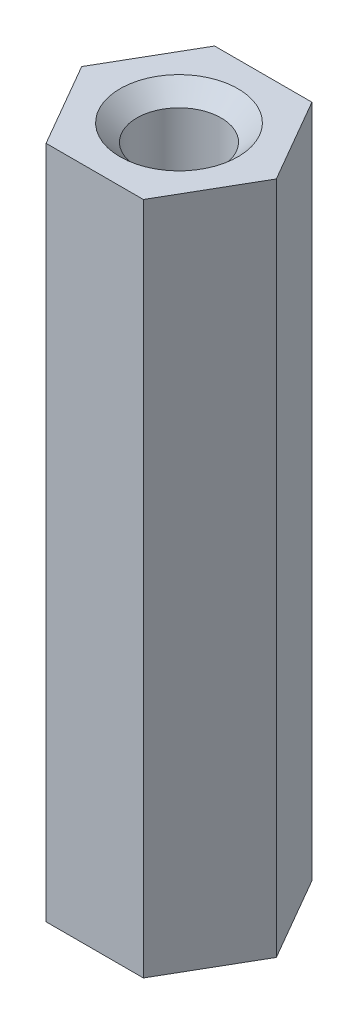
ISO-10303-21;
HEADER;
FILE_DESCRIPTION(('STEP AP214'),'2;1');
FILE_NAME('part.step','',(''),(''),'','','');
FILE_SCHEMA(('AUTOMOTIVE_DESIGN { 1 0 10303 214 1 1 1 1 }'));
ENDSEC;
DATA;
#1=APPLICATION_CONTEXT('core data for automotive mechanical design processes');
#2=APPLICATION_PROTOCOL_DEFINITION('international standard','automotive_design',2000,#1);
#3=PRODUCT_CONTEXT('',#1,'mechanical');
#4=PRODUCT('Part','Part','',(#3));
#5=PRODUCT_RELATED_PRODUCT_CATEGORY('part','',(#4));
#6=PRODUCT_DEFINITION_FORMATION('','',#4);
#7=PRODUCT_DEFINITION_CONTEXT('part definition',#1,'design');
#8=PRODUCT_DEFINITION('design','',#6,#7);
#9=PRODUCT_DEFINITION_SHAPE('','',#8);
#10=(LENGTH_UNIT() NAMED_UNIT(*) SI_UNIT(.MILLI.,.METRE.));
#11=(NAMED_UNIT(*) PLANE_ANGLE_UNIT() SI_UNIT($,.RADIAN.));
#12=(NAMED_UNIT(*) SI_UNIT($,.STERADIAN.) SOLID_ANGLE_UNIT());
#13=UNCERTAINTY_MEASURE_WITH_UNIT(LENGTH_MEASURE(1.E-05),#10,'distance_accuracy_value','');
#14=(GEOMETRIC_REPRESENTATION_CONTEXT(3) GLOBAL_UNCERTAINTY_ASSIGNED_CONTEXT((#13)) GLOBAL_UNIT_ASSIGNED_CONTEXT((#10,
#11,#12)) REPRESENTATION_CONTEXT('',''));
#15=CARTESIAN_POINT('',(0.,0.,0.));
#16=DIRECTION('',(0.,0.,1.));
#17=DIRECTION('',(1.,0.,0.));
#18=AXIS2_PLACEMENT_3D('',#15,#16,#17);
#19=CARTESIAN_POINT('',(1.44337567297406,20.,2.5));
#20=DIRECTION('',(-0.866025403784439,0.,-0.499999999999999));
#21=DIRECTION('',(-0.499999999999999,0.,0.866025403784439));
#22=AXIS2_PLACEMENT_3D('',#19,#20,#21);
#23=PLANE('',#22);
#24=DIRECTION('',(0.499999999999999,0.,-0.866025403784439));
#25=VECTOR('',#24,1.);
#26=CARTESIAN_POINT('',(1.44337567297406,0.,2.5));
#27=LINE('',#26,#25);
#28=CARTESIAN_POINT('',(1.44337567297406,0.,2.5));
#29=VERTEX_POINT('',#28);
#30=CARTESIAN_POINT('',(2.88675134594813,0.,0.));
#31=VERTEX_POINT('',#30);
#32=EDGE_CURVE('E115',#29,#31,#27,.T.);
#33=ORIENTED_EDGE('',*,*,#32,.T.);
#34=DIRECTION('',(0.,-1.,0.));
#35=VECTOR('',#34,1.);
#36=CARTESIAN_POINT('',(2.88675134594813,20.,0.));
#37=LINE('',#36,#35);
#38=CARTESIAN_POINT('',(2.88675134594813,20.,0.));
#39=VERTEX_POINT('',#38);
#40=EDGE_CURVE('E11',#39,#31,#37,.T.);
#41=ORIENTED_EDGE('',*,*,#40,.F.);
#42=DIRECTION('',(0.499999999999999,0.,-0.866025403784439));
#43=VECTOR('',#42,1.);
#44=CARTESIAN_POINT('',(1.44337567297406,20.,2.5));
#45=LINE('',#44,#43);
#46=CARTESIAN_POINT('',(1.44337567297406,20.,2.5));
#47=VERTEX_POINT('',#46);
#48=EDGE_CURVE('E126',#47,#39,#45,.T.);
#49=ORIENTED_EDGE('',*,*,#48,.F.);
#50=DIRECTION('',(0.,-1.,0.));
#51=VECTOR('',#50,1.);
#52=CARTESIAN_POINT('',(1.44337567297406,20.,2.5));
#53=LINE('',#52,#51);
#54=EDGE_CURVE('E111',#47,#29,#53,.T.);
#55=ORIENTED_EDGE('',*,*,#54,.T.);
#56=EDGE_LOOP('',(#33,#41,#49,#55));
#57=FACE_BOUND('',#56,.T.);
#58=ADVANCED_FACE('F31',(#57),#23,.F.);
#59=CARTESIAN_POINT('',(2.88675134594813,20.,0.));
#60=DIRECTION('',(-0.866025403784439,0.,0.5));
#61=DIRECTION('',(0.5,0.,0.866025403784439));
#62=AXIS2_PLACEMENT_3D('',#59,#60,#61);
#63=PLANE('',#62);
#64=DIRECTION('',(-0.5,0.,-0.866025403784439));
#65=VECTOR('',#64,1.);
#66=CARTESIAN_POINT('',(2.88675134594813,0.,0.));
#67=LINE('',#66,#65);
#68=CARTESIAN_POINT('',(1.44337567297406,0.,-2.50000000000001));
#69=VERTEX_POINT('',#68);
#70=EDGE_CURVE('E118',#31,#69,#67,.T.);
#71=ORIENTED_EDGE('',*,*,#70,.T.);
#72=DIRECTION('',(0.,-1.,0.));
#73=VECTOR('',#72,1.);
#74=CARTESIAN_POINT('',(1.44337567297406,20.,-2.50000000000001));
#75=LINE('',#74,#73);
#76=CARTESIAN_POINT('',(1.44337567297406,20.,-2.50000000000001));
#77=VERTEX_POINT('',#76);
#78=EDGE_CURVE('E39',#77,#69,#75,.T.);
#79=ORIENTED_EDGE('',*,*,#78,.F.);
#80=DIRECTION('',(-0.5,0.,-0.866025403784439));
#81=VECTOR('',#80,1.);
#82=CARTESIAN_POINT('',(2.88675134594813,20.,0.));
#83=LINE('',#82,#81);
#84=EDGE_CURVE('E84',#39,#77,#83,.T.);
#85=ORIENTED_EDGE('',*,*,#84,.F.);
#86=ORIENTED_EDGE('',*,*,#40,.T.);
#87=EDGE_LOOP('',(#71,#79,#85,#86));
#88=FACE_BOUND('',#87,.T.);
#89=ADVANCED_FACE('F151',(#88),#63,.F.);
#90=CARTESIAN_POINT('',(1.44337567297406,20.,-2.50000000000001));
#91=DIRECTION('',(0.,0.,1.));
#92=DIRECTION('',(1.,0.,0.));
#93=AXIS2_PLACEMENT_3D('',#90,#91,#92);
#94=PLANE('',#93);
#95=DIRECTION('',(-1.,0.,0.));
#96=VECTOR('',#95,1.);
#97=CARTESIAN_POINT('',(1.44337567297406,0.,-2.50000000000001));
#98=LINE('',#97,#96);
#99=CARTESIAN_POINT('',(-1.44337567297407,0.,-2.50000000000001));
#100=VERTEX_POINT('',#99);
#101=EDGE_CURVE('E121',#69,#100,#98,.T.);
#102=ORIENTED_EDGE('',*,*,#101,.T.);
#103=DIRECTION('',(0.,-1.,0.));
#104=VECTOR('',#103,1.);
#105=CARTESIAN_POINT('',(-1.44337567297407,20.,-2.50000000000001));
#106=LINE('',#105,#104);
#107=CARTESIAN_POINT('',(-1.44337567297407,20.,-2.50000000000001));
#108=VERTEX_POINT('',#107);
#109=EDGE_CURVE('E106',#108,#100,#106,.T.);
#110=ORIENTED_EDGE('',*,*,#109,.F.);
#111=DIRECTION('',(-1.,0.,0.));
#112=VECTOR('',#111,1.);
#113=CARTESIAN_POINT('',(1.44337567297406,20.,-2.50000000000001));
#114=LINE('',#113,#112);
#115=EDGE_CURVE('E97',#77,#108,#114,.T.);
#116=ORIENTED_EDGE('',*,*,#115,.F.);
#117=ORIENTED_EDGE('',*,*,#78,.T.);
#118=EDGE_LOOP('',(#102,#110,#116,#117));
#119=FACE_BOUND('',#118,.T.);
#120=ADVANCED_FACE('F132',(#119),#94,.F.);
#121=CARTESIAN_POINT('',(-1.44337567297407,20.,-2.50000000000001));
#122=DIRECTION('',(0.866025403784439,0.,0.5));
#123=DIRECTION('',(0.5,0.,-0.866025403784439));
#124=AXIS2_PLACEMENT_3D('',#121,#122,#123);
#125=PLANE('',#124);
#126=DIRECTION('',(-0.499999999999999,0.,0.866025403784439));
#127=VECTOR('',#126,1.);
#128=CARTESIAN_POINT('',(-1.44337567297407,0.,-2.50000000000001));
#129=LINE('',#128,#127);
#130=CARTESIAN_POINT('',(-2.88675134594813,0.,0.));
#131=VERTEX_POINT('',#130);
#132=EDGE_CURVE('E105',#100,#131,#129,.T.);
#133=ORIENTED_EDGE('',*,*,#132,.T.);
#134=DIRECTION('',(0.,-1.,0.));
#135=VECTOR('',#134,1.);
#136=CARTESIAN_POINT('',(-2.88675134594813,20.,0.));
#137=LINE('',#136,#135);
#138=CARTESIAN_POINT('',(-2.88675134594813,20.,0.));
#139=VERTEX_POINT('',#138);
#140=EDGE_CURVE('E102',#139,#131,#137,.T.);
#141=ORIENTED_EDGE('',*,*,#140,.F.);
#142=DIRECTION('',(-0.499999999999999,0.,0.866025403784439));
#143=VECTOR('',#142,1.);
#144=CARTESIAN_POINT('',(-1.44337567297407,20.,-2.50000000000001));
#145=LINE('',#144,#143);
#146=EDGE_CURVE('E91',#108,#139,#145,.T.);
#147=ORIENTED_EDGE('',*,*,#146,.F.);
#148=ORIENTED_EDGE('',*,*,#109,.T.);
#149=EDGE_LOOP('',(#133,#141,#147,#148));
#150=FACE_BOUND('',#149,.T.);
#151=ADVANCED_FACE('F103',(#150),#125,.F.);
#152=CARTESIAN_POINT('',(-2.88675134594813,20.,0.));
#153=DIRECTION('',(0.866025403784439,0.,-0.5));
#154=DIRECTION('',(-0.5,0.,-0.866025403784439));
#155=AXIS2_PLACEMENT_3D('',#152,#153,#154);
#156=PLANE('',#155);
#157=DIRECTION('',(0.5,0.,0.866025403784439));
#158=VECTOR('',#157,1.);
#159=CARTESIAN_POINT('',(-2.88675134594813,0.,0.));
#160=LINE('',#159,#158);
#161=CARTESIAN_POINT('',(-1.44337567297407,0.,2.5));
#162=VERTEX_POINT('',#161);
#163=EDGE_CURVE('E70',#131,#162,#160,.T.);
#164=ORIENTED_EDGE('',*,*,#163,.T.);
#165=DIRECTION('',(0.,-1.,0.));
#166=VECTOR('',#165,1.);
#167=CARTESIAN_POINT('',(-1.44337567297407,20.,2.5));
#168=LINE('',#167,#166);
#169=CARTESIAN_POINT('',(-1.44337567297407,20.,2.5));
#170=VERTEX_POINT('',#169);
#171=EDGE_CURVE('E107',#170,#162,#168,.T.);
#172=ORIENTED_EDGE('',*,*,#171,.F.);
#173=DIRECTION('',(0.5,0.,0.866025403784439));
#174=VECTOR('',#173,1.);
#175=CARTESIAN_POINT('',(-2.88675134594813,20.,0.));
#176=LINE('',#175,#174);
#177=EDGE_CURVE('E95',#139,#170,#176,.T.);
#178=ORIENTED_EDGE('',*,*,#177,.F.);
#179=ORIENTED_EDGE('',*,*,#140,.T.);
#180=EDGE_LOOP('',(#164,#172,#178,#179));
#181=FACE_BOUND('',#180,.T.);
#182=ADVANCED_FACE('F109',(#181),#156,.F.);
#183=CARTESIAN_POINT('',(-1.44337567297407,20.,2.5));
#184=DIRECTION('',(0.,0.,-1.));
#185=DIRECTION('',(-1.,0.,0.));
#186=AXIS2_PLACEMENT_3D('',#183,#184,#185);
#187=PLANE('',#186);
#188=DIRECTION('',(1.,0.,0.));
#189=VECTOR('',#188,1.);
#190=CARTESIAN_POINT('',(-1.44337567297407,0.,2.5));
#191=LINE('',#190,#189);
#192=EDGE_CURVE('E76',#162,#29,#191,.T.);
#193=ORIENTED_EDGE('',*,*,#192,.T.);
#194=ORIENTED_EDGE('',*,*,#54,.F.);
#195=DIRECTION('',(1.,0.,0.));
#196=VECTOR('',#195,1.);
#197=CARTESIAN_POINT('',(-1.44337567297407,20.,2.5));
#198=LINE('',#197,#196);
#199=EDGE_CURVE('E47',#170,#47,#198,.T.);
#200=ORIENTED_EDGE('',*,*,#199,.F.);
#201=ORIENTED_EDGE('',*,*,#171,.T.);
#202=EDGE_LOOP('',(#193,#194,#200,#201));
#203=FACE_BOUND('',#202,.T.);
#204=ADVANCED_FACE('F139',(#203),#187,.F.);
#205=CARTESIAN_POINT('',(2.88675134594813,20.,0.));
#206=DIRECTION('',(0.,1.,0.));
#207=DIRECTION('',(0.,0.,1.));
#208=AXIS2_PLACEMENT_3D('',#205,#206,#207);
#209=PLANE('',#208);
#210=CARTESIAN_POINT('',(0.,20.,0.));
#211=DIRECTION('',(0.,1.,0.));
#212=DIRECTION('',(0.,0.,1.));
#213=AXIS2_PLACEMENT_3D('',#210,#211,#212);
#214=CIRCLE('',#213,1.75);
#215=CARTESIAN_POINT('',(0.,20.,1.75));
#216=VERTEX_POINT('',#215);
#217=EDGE_CURVE('E227',#216,#216,#214,.T.);
#218=ORIENTED_EDGE('',*,*,#217,.F.);
#219=EDGE_LOOP('',(#218));
#220=FACE_BOUND('',#219,.T.);
#221=ORIENTED_EDGE('',*,*,#48,.T.);
#222=ORIENTED_EDGE('',*,*,#84,.T.);
#223=ORIENTED_EDGE('',*,*,#115,.T.);
#224=ORIENTED_EDGE('',*,*,#146,.T.);
#225=ORIENTED_EDGE('',*,*,#177,.T.);
#226=ORIENTED_EDGE('',*,*,#199,.T.);
#227=EDGE_LOOP('',(#221,#222,#223,#224,#225,#226));
#228=FACE_BOUND('',#227,.T.);
#229=ADVANCED_FACE('F93',(#220,#228),#209,.T.);
#230=CARTESIAN_POINT('',(2.88675134594813,0.,0.));
#231=DIRECTION('',(0.,1.,0.));
#232=DIRECTION('',(0.,0.,1.));
#233=AXIS2_PLACEMENT_3D('',#230,#231,#232);
#234=PLANE('',#233);
#235=CARTESIAN_POINT('',(0.,0.,0.));
#236=DIRECTION('',(0.,1.,0.));
#237=DIRECTION('',(0.,0.,1.));
#238=AXIS2_PLACEMENT_3D('',#235,#236,#237);
#239=CIRCLE('',#238,1.75);
#240=CARTESIAN_POINT('',(0.,0.,1.75));
#241=VERTEX_POINT('',#240);
#242=EDGE_CURVE('E228',#241,#241,#239,.T.);
#243=ORIENTED_EDGE('',*,*,#242,.T.);
#244=EDGE_LOOP('',(#243));
#245=FACE_BOUND('',#244,.T.);
#246=ORIENTED_EDGE('',*,*,#32,.F.);
#247=ORIENTED_EDGE('',*,*,#192,.F.);
#248=ORIENTED_EDGE('',*,*,#163,.F.);
#249=ORIENTED_EDGE('',*,*,#132,.F.);
#250=ORIENTED_EDGE('',*,*,#101,.F.);
#251=ORIENTED_EDGE('',*,*,#70,.F.);
#252=EDGE_LOOP('',(#246,#247,#248,#249,#250,#251));
#253=FACE_BOUND('',#252,.T.);
#254=ADVANCED_FACE('F135',(#245,#253),#234,.F.);
#255=CARTESIAN_POINT('',(0.,0.5,0.));
#256=DIRECTION('',(0.,-1.,0.));
#257=DIRECTION('',(0.,0.,-1.));
#258=AXIS2_PLACEMENT_3D('',#255,#256,#257);
#259=CONICAL_SURFACE('',#258,1.25,0.785398163397448);
#260=ORIENTED_EDGE('',*,*,#242,.F.);
#261=EDGE_LOOP('',(#260));
#262=FACE_BOUND('',#261,.T.);
#263=CARTESIAN_POINT('',(0.,0.5,0.));
#264=DIRECTION('',(0.,1.,0.));
#265=DIRECTION('',(0.,0.,1.));
#266=AXIS2_PLACEMENT_3D('',#263,#264,#265);
#267=CIRCLE('',#266,1.25);
#268=CARTESIAN_POINT('',(0.,0.5,1.25));
#269=VERTEX_POINT('',#268);
#270=EDGE_CURVE('E119',#269,#269,#267,.T.);
#271=ORIENTED_EDGE('',*,*,#270,.T.);
#272=EDGE_LOOP('',(#271));
#273=FACE_BOUND('',#272,.T.);
#274=ADVANCED_FACE('F188',(#262,#273),#259,.F.);
#275=CARTESIAN_POINT('',(0.,20.,0.));
#276=DIRECTION('',(0.,1.,0.));
#277=DIRECTION('',(0.,0.,1.));
#278=AXIS2_PLACEMENT_3D('',#275,#276,#277);
#279=CYLINDRICAL_SURFACE('',#278,1.25);
#280=ORIENTED_EDGE('',*,*,#270,.F.);
#281=EDGE_LOOP('',(#280));
#282=FACE_BOUND('',#281,.T.);
#283=CARTESIAN_POINT('',(0.,19.5,0.));
#284=DIRECTION('',(0.,1.,0.));
#285=DIRECTION('',(0.,0.,1.));
#286=AXIS2_PLACEMENT_3D('',#283,#284,#285);
#287=CIRCLE('',#286,1.25);
#288=CARTESIAN_POINT('',(0.,19.5,1.25));
#289=VERTEX_POINT('',#288);
#290=EDGE_CURVE('E224',#289,#289,#287,.T.);
#291=ORIENTED_EDGE('',*,*,#290,.T.);
#292=EDGE_LOOP('',(#291));
#293=FACE_BOUND('',#292,.T.);
#294=ADVANCED_FACE('F197',(#282,#293),#279,.F.);
#295=CARTESIAN_POINT('',(0.,20.,0.));
#296=DIRECTION('',(0.,1.,0.));
#297=DIRECTION('',(0.,0.,1.));
#298=AXIS2_PLACEMENT_3D('',#295,#296,#297);
#299=CONICAL_SURFACE('',#298,1.75,0.785398163397444);
#300=ORIENTED_EDGE('',*,*,#290,.F.);
#301=EDGE_LOOP('',(#300));
#302=FACE_BOUND('',#301,.T.);
#303=ORIENTED_EDGE('',*,*,#217,.T.);
#304=EDGE_LOOP('',(#303));
#305=FACE_BOUND('',#304,.T.);
#306=ADVANCED_FACE('F207',(#302,#305),#299,.F.);
#307=CLOSED_SHELL('',(#58,#89,#120,#151,#182,#204,#229,#254,#274,#294,#306));
#308=MANIFOLD_SOLID_BREP('B2',#307);
#309=ADVANCED_BREP_SHAPE_REPRESENTATION('',(#18,#308),#14);
#310=SHAPE_DEFINITION_REPRESENTATION(#9,#309);
ENDSEC;
END-ISO-10303-21;
